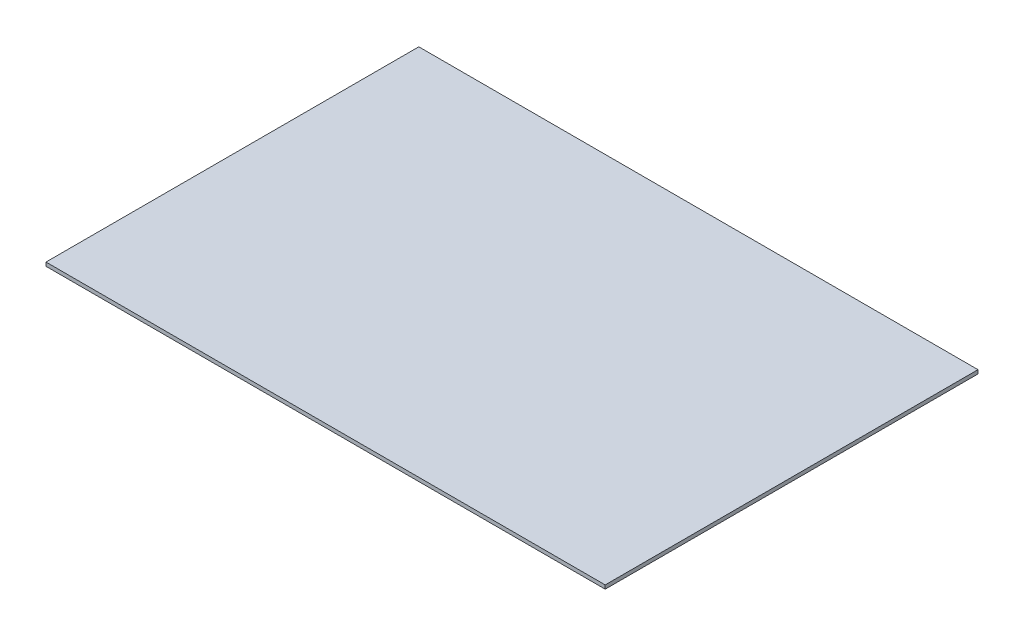
ISO-10303-21;
HEADER;
FILE_DESCRIPTION(('STEP AP214'),'2;1');
FILE_NAME('part.step','',(''),(''),'','','');
FILE_SCHEMA(('AUTOMOTIVE_DESIGN { 1 0 10303 214 1 1 1 1 }'));
ENDSEC;
DATA;
#1=APPLICATION_CONTEXT('core data for automotive mechanical design processes');
#2=APPLICATION_PROTOCOL_DEFINITION('international standard','automotive_design',2000,#1);
#3=PRODUCT_CONTEXT('',#1,'mechanical');
#4=PRODUCT('Part','Part','',(#3));
#5=PRODUCT_RELATED_PRODUCT_CATEGORY('part','',(#4));
#6=PRODUCT_DEFINITION_FORMATION('','',#4);
#7=PRODUCT_DEFINITION_CONTEXT('part definition',#1,'design');
#8=PRODUCT_DEFINITION('design','',#6,#7);
#9=PRODUCT_DEFINITION_SHAPE('','',#8);
#10=(LENGTH_UNIT() NAMED_UNIT(*) SI_UNIT(.MILLI.,.METRE.));
#11=(NAMED_UNIT(*) PLANE_ANGLE_UNIT() SI_UNIT($,.RADIAN.));
#12=(NAMED_UNIT(*) SI_UNIT($,.STERADIAN.) SOLID_ANGLE_UNIT());
#13=UNCERTAINTY_MEASURE_WITH_UNIT(LENGTH_MEASURE(1.E-05),#10,'distance_accuracy_value','');
#14=(GEOMETRIC_REPRESENTATION_CONTEXT(3) GLOBAL_UNCERTAINTY_ASSIGNED_CONTEXT((#13)) GLOBAL_UNIT_ASSIGNED_CONTEXT((#10,
#11,#12)) REPRESENTATION_CONTEXT('',''));
#15=CARTESIAN_POINT('',(0.,0.,0.));
#16=DIRECTION('',(0.,0.,1.));
#17=DIRECTION('',(1.,0.,0.));
#18=AXIS2_PLACEMENT_3D('',#15,#16,#17);
#19=CARTESIAN_POINT('',(0.,10.,0.));
#20=DIRECTION('',(1.,0.,0.));
#21=DIRECTION('',(0.,0.,-1.));
#22=AXIS2_PLACEMENT_3D('',#19,#20,#21);
#23=PLANE('',#22);
#24=DIRECTION('',(0.,0.,1.));
#25=VECTOR('',#24,1.);
#26=CARTESIAN_POINT('',(0.,0.,0.));
#27=LINE('',#26,#25);
#28=CARTESIAN_POINT('',(0.,0.,-1000.));
#29=VERTEX_POINT('',#28);
#30=CARTESIAN_POINT('',(0.,0.,0.));
#31=VERTEX_POINT('',#30);
#32=EDGE_CURVE('E94',#29,#31,#27,.T.);
#33=ORIENTED_EDGE('',*,*,#32,.T.);
#34=DIRECTION('',(0.,-1.,0.));
#35=VECTOR('',#34,1.);
#36=CARTESIAN_POINT('',(0.,10.,0.));
#37=LINE('',#36,#35);
#38=CARTESIAN_POINT('',(0.,10.,0.));
#39=VERTEX_POINT('',#38);
#40=EDGE_CURVE('E11',#39,#31,#37,.T.);
#41=ORIENTED_EDGE('',*,*,#40,.F.);
#42=DIRECTION('',(0.,0.,1.));
#43=VECTOR('',#42,1.);
#44=CARTESIAN_POINT('',(0.,10.,0.));
#45=LINE('',#44,#43);
#46=CARTESIAN_POINT('',(0.,10.,-1000.));
#47=VERTEX_POINT('',#46);
#48=EDGE_CURVE('E82',#47,#39,#45,.T.);
#49=ORIENTED_EDGE('',*,*,#48,.F.);
#50=DIRECTION('',(0.,-1.,0.));
#51=VECTOR('',#50,1.);
#52=CARTESIAN_POINT('',(0.,10.,-1000.));
#53=LINE('',#52,#51);
#54=EDGE_CURVE('E90',#47,#29,#53,.T.);
#55=ORIENTED_EDGE('',*,*,#54,.T.);
#56=EDGE_LOOP('',(#33,#41,#49,#55));
#57=FACE_BOUND('',#56,.T.);
#58=ADVANCED_FACE('F31',(#57),#23,.F.);
#59=CARTESIAN_POINT('',(0.,10.,0.));
#60=DIRECTION('',(0.,0.,-1.));
#61=DIRECTION('',(-1.,0.,0.));
#62=AXIS2_PLACEMENT_3D('',#59,#60,#61);
#63=PLANE('',#62);
#64=DIRECTION('',(1.,0.,0.));
#65=VECTOR('',#64,1.);
#66=CARTESIAN_POINT('',(0.,0.,0.));
#67=LINE('',#66,#65);
#68=CARTESIAN_POINT('',(1500.,0.,0.));
#69=VERTEX_POINT('',#68);
#70=EDGE_CURVE('E86',#31,#69,#67,.T.);
#71=ORIENTED_EDGE('',*,*,#70,.T.);
#72=DIRECTION('',(0.,-1.,0.));
#73=VECTOR('',#72,1.);
#74=CARTESIAN_POINT('',(1500.,10.,0.));
#75=LINE('',#74,#73);
#76=CARTESIAN_POINT('',(1500.,10.,0.));
#77=VERTEX_POINT('',#76);
#78=EDGE_CURVE('E39',#77,#69,#75,.T.);
#79=ORIENTED_EDGE('',*,*,#78,.F.);
#80=DIRECTION('',(1.,0.,0.));
#81=VECTOR('',#80,1.);
#82=CARTESIAN_POINT('',(0.,10.,0.));
#83=LINE('',#82,#81);
#84=EDGE_CURVE('E77',#39,#77,#83,.T.);
#85=ORIENTED_EDGE('',*,*,#84,.F.);
#86=ORIENTED_EDGE('',*,*,#40,.T.);
#87=EDGE_LOOP('',(#71,#79,#85,#86));
#88=FACE_BOUND('',#87,.T.);
#89=ADVANCED_FACE('F85',(#88),#63,.F.);
#90=CARTESIAN_POINT('',(1500.,10.,0.));
#91=DIRECTION('',(-1.,0.,0.));
#92=DIRECTION('',(0.,0.,1.));
#93=AXIS2_PLACEMENT_3D('',#90,#91,#92);
#94=PLANE('',#93);
#95=DIRECTION('',(0.,0.,-1.));
#96=VECTOR('',#95,1.);
#97=CARTESIAN_POINT('',(1500.,0.,0.));
#98=LINE('',#97,#96);
#99=CARTESIAN_POINT('',(1500.,0.,-1000.));
#100=VERTEX_POINT('',#99);
#101=EDGE_CURVE('E64',#69,#100,#98,.T.);
#102=ORIENTED_EDGE('',*,*,#101,.T.);
#103=DIRECTION('',(0.,-1.,0.));
#104=VECTOR('',#103,1.);
#105=CARTESIAN_POINT('',(1500.,10.,-1000.));
#106=LINE('',#105,#104);
#107=CARTESIAN_POINT('',(1500.,10.,-1000.));
#108=VERTEX_POINT('',#107);
#109=EDGE_CURVE('E87',#108,#100,#106,.T.);
#110=ORIENTED_EDGE('',*,*,#109,.F.);
#111=DIRECTION('',(0.,0.,-1.));
#112=VECTOR('',#111,1.);
#113=CARTESIAN_POINT('',(1500.,10.,0.));
#114=LINE('',#113,#112);
#115=EDGE_CURVE('E80',#77,#108,#114,.T.);
#116=ORIENTED_EDGE('',*,*,#115,.F.);
#117=ORIENTED_EDGE('',*,*,#78,.T.);
#118=EDGE_LOOP('',(#102,#110,#116,#117));
#119=FACE_BOUND('',#118,.T.);
#120=ADVANCED_FACE('F88',(#119),#94,.F.);
#121=CARTESIAN_POINT('',(0.,10.,-1000.));
#122=DIRECTION('',(0.,0.,1.));
#123=DIRECTION('',(1.,0.,0.));
#124=AXIS2_PLACEMENT_3D('',#121,#122,#123);
#125=PLANE('',#124);
#126=DIRECTION('',(-1.,0.,0.));
#127=VECTOR('',#126,1.);
#128=CARTESIAN_POINT('',(0.,0.,-1000.));
#129=LINE('',#128,#127);
#130=EDGE_CURVE('E70',#100,#29,#129,.T.);
#131=ORIENTED_EDGE('',*,*,#130,.T.);
#132=ORIENTED_EDGE('',*,*,#54,.F.);
#133=DIRECTION('',(-1.,0.,0.));
#134=VECTOR('',#133,1.);
#135=CARTESIAN_POINT('',(0.,10.,-1000.));
#136=LINE('',#135,#134);
#137=EDGE_CURVE('E47',#108,#47,#136,.T.);
#138=ORIENTED_EDGE('',*,*,#137,.F.);
#139=ORIENTED_EDGE('',*,*,#109,.T.);
#140=EDGE_LOOP('',(#131,#132,#138,#139));
#141=FACE_BOUND('',#140,.T.);
#142=ADVANCED_FACE('F101',(#141),#125,.F.);
#143=CARTESIAN_POINT('',(0.,10.,-1000.));
#144=DIRECTION('',(0.,-1.,0.));
#145=DIRECTION('',(0.,0.,-1.));
#146=AXIS2_PLACEMENT_3D('',#143,#144,#145);
#147=PLANE('',#146);
#148=ORIENTED_EDGE('',*,*,#48,.T.);
#149=ORIENTED_EDGE('',*,*,#84,.T.);
#150=ORIENTED_EDGE('',*,*,#115,.T.);
#151=ORIENTED_EDGE('',*,*,#137,.T.);
#152=EDGE_LOOP('',(#148,#149,#150,#151));
#153=FACE_BOUND('',#152,.T.);
#154=ADVANCED_FACE('F78',(#153),#147,.F.);
#155=CARTESIAN_POINT('',(0.,0.,-1000.));
#156=DIRECTION('',(0.,-1.,0.));
#157=DIRECTION('',(0.,0.,-1.));
#158=AXIS2_PLACEMENT_3D('',#155,#156,#157);
#159=PLANE('',#158);
#160=ORIENTED_EDGE('',*,*,#32,.F.);
#161=ORIENTED_EDGE('',*,*,#130,.F.);
#162=ORIENTED_EDGE('',*,*,#101,.F.);
#163=ORIENTED_EDGE('',*,*,#70,.F.);
#164=EDGE_LOOP('',(#160,#161,#162,#163));
#165=FACE_BOUND('',#164,.T.);
#166=ADVANCED_FACE('F104',(#165),#159,.T.);
#167=CLOSED_SHELL('',(#58,#89,#120,#142,#154,#166));
#168=MANIFOLD_SOLID_BREP('B2',#167);
#169=ADVANCED_BREP_SHAPE_REPRESENTATION('',(#18,#168),#14);
#170=SHAPE_DEFINITION_REPRESENTATION(#9,#169);
ENDSEC;
END-ISO-10303-21;
